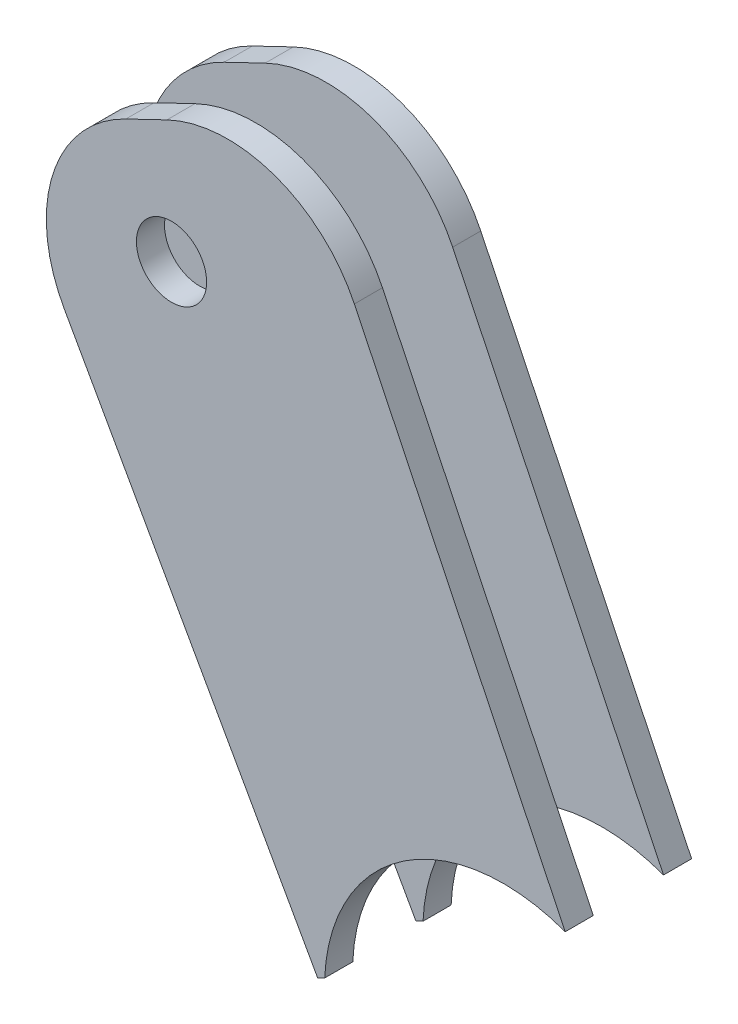
ISO-10303-21;
HEADER;
FILE_DESCRIPTION(('STEP AP214'),'2;1');
FILE_NAME('part.step','',(''),(''),'','','');
FILE_SCHEMA(('AUTOMOTIVE_DESIGN { 1 0 10303 214 1 1 1 1 }'));
ENDSEC;
DATA;
#1=APPLICATION_CONTEXT('core data for automotive mechanical design processes');
#2=APPLICATION_PROTOCOL_DEFINITION('international standard','automotive_design',2000,#1);
#3=PRODUCT_CONTEXT('',#1,'mechanical');
#4=PRODUCT('Part','Part','',(#3));
#5=PRODUCT_RELATED_PRODUCT_CATEGORY('part','',(#4));
#6=PRODUCT_DEFINITION_FORMATION('','',#4);
#7=PRODUCT_DEFINITION_CONTEXT('part definition',#1,'design');
#8=PRODUCT_DEFINITION('design','',#6,#7);
#9=PRODUCT_DEFINITION_SHAPE('','',#8);
#10=(LENGTH_UNIT() NAMED_UNIT(*) SI_UNIT(.MILLI.,.METRE.));
#11=(NAMED_UNIT(*) PLANE_ANGLE_UNIT() SI_UNIT($,.RADIAN.));
#12=(NAMED_UNIT(*) SI_UNIT($,.STERADIAN.) SOLID_ANGLE_UNIT());
#13=UNCERTAINTY_MEASURE_WITH_UNIT(LENGTH_MEASURE(1.E-05),#10,'distance_accuracy_value','');
#14=(GEOMETRIC_REPRESENTATION_CONTEXT(3) GLOBAL_UNCERTAINTY_ASSIGNED_CONTEXT((#13)) GLOBAL_UNIT_ASSIGNED_CONTEXT((#10,
#11,#12)) REPRESENTATION_CONTEXT('',''));
#15=CARTESIAN_POINT('',(0.,0.,0.));
#16=DIRECTION('',(0.,0.,1.));
#17=DIRECTION('',(1.,0.,0.));
#18=AXIS2_PLACEMENT_3D('',#15,#16,#17);
#19=CARTESIAN_POINT('',(211.866954819544,210.226139875916,7.));
#20=DIRECTION('',(0.,0.,1.));
#21=DIRECTION('',(-1.,0.,0.));
#22=AXIS2_PLACEMENT_3D('',#19,#20,#21);
#23=PLANE('',#22);
#24=CARTESIAN_POINT('',(234.421204701867,172.795325306794,7.));
#25=DIRECTION('',(0.,0.,-1.));
#26=DIRECTION('',(-1.,0.,0.));
#27=AXIS2_PLACEMENT_3D('',#24,#25,#26);
#28=CIRCLE('',#27,12.7458474253196);
#29=CARTESIAN_POINT('',(221.68738383472,173.348888955287,7.));
#30=VERTEX_POINT('',#29);
#31=CARTESIAN_POINT('',(238.810781533645,184.761454247577,7.));
#32=VERTEX_POINT('',#31);
#33=EDGE_CURVE('E130',#30,#32,#28,.T.);
#34=ORIENTED_EDGE('',*,*,#33,.T.);
#35=DIRECTION('',(0.433531044791866,-0.901138631511086,0.));
#36=VECTOR('',#35,1.);
#37=CARTESIAN_POINT('',(223.798382976734,215.966260578734,7.));
#38=LINE('',#37,#36);
#39=CARTESIAN_POINT('',(223.798382976734,215.966260578734,7.));
#40=VERTEX_POINT('',#39);
#41=EDGE_CURVE('E111',#40,#32,#38,.T.);
#42=ORIENTED_EDGE('',*,*,#41,.F.);
#43=CARTESIAN_POINT('',(214.786996661623,211.630950130815,7.));
#44=DIRECTION('',(0.,0.,-1.));
#45=DIRECTION('',(-1.,0.,0.));
#46=AXIS2_PLACEMENT_3D('',#43,#44,#45);
#47=CIRCLE('',#46,10.);
#48=CARTESIAN_POINT('',(210.451686213704,220.642336445926,7.));
#49=VERTEX_POINT('',#48);
#50=EDGE_CURVE('E122',#49,#40,#47,.T.);
#51=ORIENTED_EDGE('',*,*,#50,.F.);
#52=DIRECTION('',(0.901138631511083,0.433531044791873,0.));
#53=VECTOR('',#52,1.);
#54=CARTESIAN_POINT('',(207.531644371625,219.237526191027,7.));
#55=LINE('',#54,#53);
#56=CARTESIAN_POINT('',(207.531644371625,219.237526191027,7.));
#57=VERTEX_POINT('',#56);
#58=EDGE_CURVE('E126',#57,#49,#55,.T.);
#59=ORIENTED_EDGE('',*,*,#58,.F.);
#60=CARTESIAN_POINT('',(211.866954819544,210.226139875916,7.));
#61=DIRECTION('',(0.,0.,-1.));
#62=DIRECTION('',(-1.,0.,0.));
#63=AXIS2_PLACEMENT_3D('',#60,#61,#62);
#64=CIRCLE('',#63,9.99999999999998);
#65=CARTESIAN_POINT('',(203.140807268659,205.342048463975,7.));
#66=VERTEX_POINT('',#65);
#67=EDGE_CURVE('E155',#66,#57,#64,.T.);
#68=ORIENTED_EDGE('',*,*,#67,.F.);
#69=DIRECTION('',(-0.488409141194116,0.872614755088422,0.));
#70=VECTOR('',#69,1.);
#71=CARTESIAN_POINT('',(221.183345822055,173.106400043366,7.));
#72=LINE('',#71,#70);
#73=CARTESIAN_POINT('',(221.183345822055,173.106400043366,7.));
#74=VERTEX_POINT('',#73);
#75=EDGE_CURVE('E134',#74,#66,#72,.T.);
#76=ORIENTED_EDGE('',*,*,#75,.F.);
#77=DIRECTION('',(-0.901138631511086,-0.433531044791867,0.));
#78=VECTOR('',#77,1.);
#79=CARTESIAN_POINT('',(240.051018031475,182.183495797239,7.));
#80=LINE('',#79,#78);
#81=EDGE_CURVE('E131',#30,#74,#80,.T.);
#82=ORIENTED_EDGE('',*,*,#81,.F.);
#83=EDGE_LOOP('',(#34,#42,#51,#59,#68,#76,#82));
#84=FACE_BOUND('',#83,.T.);
#85=CARTESIAN_POINT('',(210.781303050667,212.057553234732,7.));
#86=DIRECTION('',(0.,0.,-1.));
#87=DIRECTION('',(-1.,0.,0.));
#88=AXIS2_PLACEMENT_3D('',#85,#86,#87);
#89=CIRCLE('',#88,2.5);
#90=CARTESIAN_POINT('',(208.281303050667,212.057553234732,7.));
#91=VERTEX_POINT('',#90);
#92=EDGE_CURVE('E143',#91,#91,#89,.T.);
#93=ORIENTED_EDGE('',*,*,#92,.T.);
#94=EDGE_LOOP('',(#93));
#95=FACE_BOUND('',#94,.T.);
#96=ADVANCED_FACE('F47',(#84,#95),#23,.T.);
#97=CARTESIAN_POINT('',(211.866954819544,210.226139875916,5.));
#98=DIRECTION('',(0.,0.,1.));
#99=DIRECTION('',(-1.,0.,0.));
#100=AXIS2_PLACEMENT_3D('',#97,#98,#99);
#101=PLANE('',#100);
#102=DIRECTION('',(-0.901138631511086,-0.433531044791867,0.));
#103=VECTOR('',#102,1.);
#104=CARTESIAN_POINT('',(240.051018031475,182.183495797239,5.));
#105=LINE('',#104,#103);
#106=CARTESIAN_POINT('',(221.68738383472,173.348888955287,5.));
#107=VERTEX_POINT('',#106);
#108=CARTESIAN_POINT('',(221.183345822055,173.106400043366,5.));
#109=VERTEX_POINT('',#108);
#110=EDGE_CURVE('E149',#107,#109,#105,.T.);
#111=ORIENTED_EDGE('',*,*,#110,.T.);
#112=DIRECTION('',(-0.488409141194116,0.872614755088422,0.));
#113=VECTOR('',#112,1.);
#114=CARTESIAN_POINT('',(221.183345822055,173.106400043366,5.));
#115=LINE('',#114,#113);
#116=CARTESIAN_POINT('',(203.140807268659,205.342048463975,5.));
#117=VERTEX_POINT('',#116);
#118=EDGE_CURVE('E152',#109,#117,#115,.T.);
#119=ORIENTED_EDGE('',*,*,#118,.T.);
#120=CARTESIAN_POINT('',(211.866954819544,210.226139875916,5.));
#121=DIRECTION('',(0.,0.,-1.));
#122=DIRECTION('',(-1.,0.,0.));
#123=AXIS2_PLACEMENT_3D('',#120,#121,#122);
#124=CIRCLE('',#123,9.99999999999998);
#125=CARTESIAN_POINT('',(207.531644371625,219.237526191027,5.));
#126=VERTEX_POINT('',#125);
#127=EDGE_CURVE('E139',#117,#126,#124,.T.);
#128=ORIENTED_EDGE('',*,*,#127,.T.);
#129=DIRECTION('',(0.901138631511083,0.433531044791873,0.));
#130=VECTOR('',#129,1.);
#131=CARTESIAN_POINT('',(207.531644371625,219.237526191027,5.));
#132=LINE('',#131,#130);
#133=CARTESIAN_POINT('',(210.451686213704,220.642336445926,5.));
#134=VERTEX_POINT('',#133);
#135=EDGE_CURVE('E142',#126,#134,#132,.T.);
#136=ORIENTED_EDGE('',*,*,#135,.T.);
#137=CARTESIAN_POINT('',(214.786996661623,211.630950130815,5.));
#138=DIRECTION('',(0.,0.,-1.));
#139=DIRECTION('',(-1.,0.,0.));
#140=AXIS2_PLACEMENT_3D('',#137,#138,#139);
#141=CIRCLE('',#140,10.);
#142=CARTESIAN_POINT('',(223.798382976734,215.966260578734,5.));
#143=VERTEX_POINT('',#142);
#144=EDGE_CURVE('E146',#134,#143,#141,.T.);
#145=ORIENTED_EDGE('',*,*,#144,.T.);
#146=DIRECTION('',(0.433531044791866,-0.901138631511086,0.));
#147=VECTOR('',#146,1.);
#148=CARTESIAN_POINT('',(223.798382976734,215.966260578734,5.));
#149=LINE('',#148,#147);
#150=CARTESIAN_POINT('',(238.810781533645,184.761454247577,5.));
#151=VERTEX_POINT('',#150);
#152=EDGE_CURVE('E114',#143,#151,#149,.T.);
#153=ORIENTED_EDGE('',*,*,#152,.T.);
#154=CARTESIAN_POINT('',(234.421204701867,172.795325306794,5.));
#155=DIRECTION('',(0.,0.,-1.));
#156=DIRECTION('',(-1.,0.,0.));
#157=AXIS2_PLACEMENT_3D('',#154,#155,#156);
#158=CIRCLE('',#157,12.7458474253196);
#159=EDGE_CURVE('E180',#107,#151,#158,.T.);
#160=ORIENTED_EDGE('',*,*,#159,.F.);
#161=EDGE_LOOP('',(#111,#119,#128,#136,#145,#153,#160));
#162=FACE_BOUND('',#161,.T.);
#163=CARTESIAN_POINT('',(210.781303050667,212.057553234732,5.));
#164=DIRECTION('',(0.,0.,-1.));
#165=DIRECTION('',(-1.,0.,0.));
#166=AXIS2_PLACEMENT_3D('',#163,#164,#165);
#167=CIRCLE('',#166,2.5);
#168=CARTESIAN_POINT('',(208.281303050667,212.057553234732,5.));
#169=VERTEX_POINT('',#168);
#170=EDGE_CURVE('E171',#169,#169,#167,.T.);
#171=ORIENTED_EDGE('',*,*,#170,.F.);
#172=EDGE_LOOP('',(#171));
#173=FACE_BOUND('',#172,.T.);
#174=ADVANCED_FACE('F161',(#162,#173),#101,.F.);
#175=CARTESIAN_POINT('',(211.866954819544,210.226139875916,7.));
#176=DIRECTION('',(0.,0.,-1.));
#177=DIRECTION('',(1.,0.,0.));
#178=AXIS2_PLACEMENT_3D('',#175,#176,#177);
#179=CYLINDRICAL_SURFACE('',#178,9.99999999999998);
#180=ORIENTED_EDGE('',*,*,#127,.F.);
#181=DIRECTION('',(0.,0.,-1.));
#182=VECTOR('',#181,1.);
#183=CARTESIAN_POINT('',(203.140807268659,205.342048463975,7.));
#184=LINE('',#183,#182);
#185=EDGE_CURVE('E69',#66,#117,#184,.T.);
#186=ORIENTED_EDGE('',*,*,#185,.F.);
#187=ORIENTED_EDGE('',*,*,#67,.T.);
#188=DIRECTION('',(0.,0.,-1.));
#189=VECTOR('',#188,1.);
#190=CARTESIAN_POINT('',(207.531644371625,219.237526191027,7.));
#191=LINE('',#190,#189);
#192=EDGE_CURVE('E55',#57,#126,#191,.T.);
#193=ORIENTED_EDGE('',*,*,#192,.T.);
#194=EDGE_LOOP('',(#180,#186,#187,#193));
#195=FACE_BOUND('',#194,.T.);
#196=ADVANCED_FACE('F49',(#195),#179,.T.);
#197=CARTESIAN_POINT('',(207.531644371625,219.237526191027,7.));
#198=DIRECTION('',(0.433531044791873,-0.901138631511083,0.));
#199=DIRECTION('',(0.901138631511083,0.433531044791873,0.));
#200=AXIS2_PLACEMENT_3D('',#197,#198,#199);
#201=PLANE('',#200);
#202=ORIENTED_EDGE('',*,*,#135,.F.);
#203=ORIENTED_EDGE('',*,*,#192,.F.);
#204=ORIENTED_EDGE('',*,*,#58,.T.);
#205=DIRECTION('',(0.,0.,-1.));
#206=VECTOR('',#205,1.);
#207=CARTESIAN_POINT('',(210.451686213704,220.642336445926,7.));
#208=LINE('',#207,#206);
#209=EDGE_CURVE('E118',#49,#134,#208,.T.);
#210=ORIENTED_EDGE('',*,*,#209,.T.);
#211=EDGE_LOOP('',(#202,#203,#204,#210));
#212=FACE_BOUND('',#211,.T.);
#213=ADVANCED_FACE('F159',(#212),#201,.F.);
#214=CARTESIAN_POINT('',(214.786996661623,211.630950130815,7.));
#215=DIRECTION('',(0.,0.,-1.));
#216=DIRECTION('',(1.,0.,0.));
#217=AXIS2_PLACEMENT_3D('',#214,#215,#216);
#218=CYLINDRICAL_SURFACE('',#217,10.);
#219=ORIENTED_EDGE('',*,*,#144,.F.);
#220=ORIENTED_EDGE('',*,*,#209,.F.);
#221=ORIENTED_EDGE('',*,*,#50,.T.);
#222=DIRECTION('',(0.,0.,-1.));
#223=VECTOR('',#222,1.);
#224=CARTESIAN_POINT('',(223.798382976734,215.966260578734,7.));
#225=LINE('',#224,#223);
#226=EDGE_CURVE('E106',#40,#143,#225,.T.);
#227=ORIENTED_EDGE('',*,*,#226,.T.);
#228=EDGE_LOOP('',(#219,#220,#221,#227));
#229=FACE_BOUND('',#228,.T.);
#230=ADVANCED_FACE('F123',(#229),#218,.T.);
#231=CARTESIAN_POINT('',(223.798382976734,215.966260578734,7.));
#232=DIRECTION('',(-0.901138631511086,-0.433531044791866,0.));
#233=DIRECTION('',(0.433531044791866,-0.901138631511086,0.));
#234=AXIS2_PLACEMENT_3D('',#231,#232,#233);
#235=PLANE('',#234);
#236=ORIENTED_EDGE('',*,*,#152,.F.);
#237=ORIENTED_EDGE('',*,*,#226,.F.);
#238=ORIENTED_EDGE('',*,*,#41,.T.);
#239=DIRECTION('',(0.,0.,-1.));
#240=VECTOR('',#239,1.);
#241=CARTESIAN_POINT('',(238.810781533645,184.761454247577,10.));
#242=LINE('',#241,#240);
#243=EDGE_CURVE('E174',#151,#32,#242,.F.);
#244=ORIENTED_EDGE('',*,*,#243,.F.);
#245=EDGE_LOOP('',(#236,#237,#238,#244));
#246=FACE_BOUND('',#245,.T.);
#247=ADVANCED_FACE('F108',(#246),#235,.F.);
#248=CARTESIAN_POINT('',(240.051018031475,182.183495797239,7.));
#249=DIRECTION('',(-0.433531044791867,0.901138631511086,0.));
#250=DIRECTION('',(-0.901138631511086,-0.433531044791867,0.));
#251=AXIS2_PLACEMENT_3D('',#248,#249,#250);
#252=PLANE('',#251);
#253=ORIENTED_EDGE('',*,*,#81,.T.);
#254=DIRECTION('',(0.,0.,-1.));
#255=VECTOR('',#254,1.);
#256=CARTESIAN_POINT('',(221.183345822055,173.106400043366,7.));
#257=LINE('',#256,#255);
#258=EDGE_CURVE('E119',#74,#109,#257,.T.);
#259=ORIENTED_EDGE('',*,*,#258,.T.);
#260=ORIENTED_EDGE('',*,*,#110,.F.);
#261=DIRECTION('',(0.,0.,-1.));
#262=VECTOR('',#261,1.);
#263=CARTESIAN_POINT('',(221.68738383472,173.348888955287,10.));
#264=LINE('',#263,#262);
#265=EDGE_CURVE('E12',#30,#107,#264,.T.);
#266=ORIENTED_EDGE('',*,*,#265,.F.);
#267=EDGE_LOOP('',(#253,#259,#260,#266));
#268=FACE_BOUND('',#267,.T.);
#269=ADVANCED_FACE('F167',(#268),#252,.F.);
#270=CARTESIAN_POINT('',(221.183345822055,173.106400043366,7.));
#271=DIRECTION('',(0.872614755088422,0.488409141194116,0.));
#272=DIRECTION('',(-0.488409141194116,0.872614755088422,0.));
#273=AXIS2_PLACEMENT_3D('',#270,#271,#272);
#274=PLANE('',#273);
#275=ORIENTED_EDGE('',*,*,#118,.F.);
#276=ORIENTED_EDGE('',*,*,#258,.F.);
#277=ORIENTED_EDGE('',*,*,#75,.T.);
#278=ORIENTED_EDGE('',*,*,#185,.T.);
#279=EDGE_LOOP('',(#275,#276,#277,#278));
#280=FACE_BOUND('',#279,.T.);
#281=ADVANCED_FACE('F164',(#280),#274,.F.);
#282=CARTESIAN_POINT('',(210.781303050667,212.057553234732,7.));
#283=DIRECTION('',(0.,0.,-1.));
#284=DIRECTION('',(1.,0.,0.));
#285=AXIS2_PLACEMENT_3D('',#282,#283,#284);
#286=CYLINDRICAL_SURFACE('',#285,2.5);
#287=ORIENTED_EDGE('',*,*,#92,.F.);
#288=EDGE_LOOP('',(#287));
#289=FACE_BOUND('',#288,.T.);
#290=ORIENTED_EDGE('',*,*,#170,.T.);
#291=EDGE_LOOP('',(#290));
#292=FACE_BOUND('',#291,.T.);
#293=ADVANCED_FACE('F185',(#289,#292),#286,.F.);
#294=CARTESIAN_POINT('',(234.421204701867,172.795325306794,10.));
#295=DIRECTION('',(0.,0.,-1.));
#296=DIRECTION('',(1.,0.,0.));
#297=AXIS2_PLACEMENT_3D('',#294,#295,#296);
#298=CYLINDRICAL_SURFACE('',#297,12.7458474253196);
#299=ORIENTED_EDGE('',*,*,#159,.T.);
#300=ORIENTED_EDGE('',*,*,#243,.T.);
#301=ORIENTED_EDGE('',*,*,#33,.F.);
#302=ORIENTED_EDGE('',*,*,#265,.T.);
#303=EDGE_LOOP('',(#299,#300,#301,#302));
#304=FACE_BOUND('',#303,.T.);
#305=ADVANCED_FACE('F182',(#304),#298,.F.);
#306=CLOSED_SHELL('',(#96,#174,#196,#213,#230,#247,#269,#281,#293,#305));
#307=MANIFOLD_SOLID_BREP('B2',#306);
#308=CARTESIAN_POINT('',(211.866954819544,210.226139875916,-2.));
#309=DIRECTION('',(0.,0.,-1.));
#310=DIRECTION('',(1.,0.,0.));
#311=AXIS2_PLACEMENT_3D('',#308,#309,#310);
#312=PLANE('',#311);
#313=CARTESIAN_POINT('',(234.421204701867,172.795325306794,-2.));
#314=DIRECTION('',(0.,0.,1.));
#315=DIRECTION('',(1.,0.,0.));
#316=AXIS2_PLACEMENT_3D('',#313,#314,#315);
#317=CIRCLE('',#316,12.7458474253196);
#318=CARTESIAN_POINT('',(238.810781533645,184.761454247577,-2.));
#319=VERTEX_POINT('',#318);
#320=CARTESIAN_POINT('',(221.68738383472,173.348888955287,-2.));
#321=VERTEX_POINT('',#320);
#322=EDGE_CURVE('E390',#319,#321,#317,.T.);
#323=ORIENTED_EDGE('',*,*,#322,.T.);
#324=DIRECTION('',(0.901138631511086,0.433531044791867,0.));
#325=VECTOR('',#324,1.);
#326=CARTESIAN_POINT('',(240.051018031475,182.183495797239,-2.));
#327=LINE('',#326,#325);
#328=CARTESIAN_POINT('',(221.183345822055,173.106400043366,-2.));
#329=VERTEX_POINT('',#328);
#330=EDGE_CURVE('E375',#329,#321,#327,.T.);
#331=ORIENTED_EDGE('',*,*,#330,.F.);
#332=DIRECTION('',(0.488409141194116,-0.872614755088422,0.));
#333=VECTOR('',#332,1.);
#334=CARTESIAN_POINT('',(221.183345822055,173.106400043366,-2.));
#335=LINE('',#334,#333);
#336=CARTESIAN_POINT('',(203.140807268659,205.342048463975,-2.));
#337=VERTEX_POINT('',#336);
#338=EDGE_CURVE('E354',#337,#329,#335,.T.);
#339=ORIENTED_EDGE('',*,*,#338,.F.);
#340=CARTESIAN_POINT('',(211.866954819544,210.226139875916,-2.));
#341=DIRECTION('',(0.,0.,1.));
#342=DIRECTION('',(1.,0.,0.));
#343=AXIS2_PLACEMENT_3D('',#340,#341,#342);
#344=CIRCLE('',#343,9.99999999999998);
#345=CARTESIAN_POINT('',(207.531644371625,219.237526191027,-2.));
#346=VERTEX_POINT('',#345);
#347=EDGE_CURVE('E334',#346,#337,#344,.T.);
#348=ORIENTED_EDGE('',*,*,#347,.F.);
#349=DIRECTION('',(-0.901138631511086,-0.433531044791866,0.));
#350=VECTOR('',#349,1.);
#351=CARTESIAN_POINT('',(207.531644371625,219.237526191027,-2.));
#352=LINE('',#351,#350);
#353=CARTESIAN_POINT('',(210.451686213704,220.642336445926,-2.));
#354=VERTEX_POINT('',#353);
#355=EDGE_CURVE('E345',#354,#346,#352,.T.);
#356=ORIENTED_EDGE('',*,*,#355,.F.);
#357=CARTESIAN_POINT('',(214.786996661623,211.630950130815,-2.));
#358=DIRECTION('',(0.,0.,1.));
#359=DIRECTION('',(-1.,0.,0.));
#360=AXIS2_PLACEMENT_3D('',#357,#358,#359);
#361=CIRCLE('',#360,9.99999999999999);
#362=CARTESIAN_POINT('',(223.798382976734,215.966260578734,-2.));
#363=VERTEX_POINT('',#362);
#364=EDGE_CURVE('E349',#363,#354,#361,.T.);
#365=ORIENTED_EDGE('',*,*,#364,.F.);
#366=DIRECTION('',(-0.433531044791866,0.901138631511086,0.));
#367=VECTOR('',#366,1.);
#368=CARTESIAN_POINT('',(223.798382976734,215.966260578734,-2.));
#369=LINE('',#368,#367);
#370=EDGE_CURVE('E382',#319,#363,#369,.T.);
#371=ORIENTED_EDGE('',*,*,#370,.F.);
#372=EDGE_LOOP('',(#323,#331,#339,#348,#356,#365,#371));
#373=FACE_BOUND('',#372,.T.);
#374=CARTESIAN_POINT('',(210.781303050667,212.057553234732,-2.));
#375=DIRECTION('',(0.,0.,1.));
#376=DIRECTION('',(1.,0.,0.));
#377=AXIS2_PLACEMENT_3D('',#374,#375,#376);
#378=CIRCLE('',#377,2.5);
#379=CARTESIAN_POINT('',(213.281303050667,212.057553234732,-2.));
#380=VERTEX_POINT('',#379);
#381=EDGE_CURVE('E363',#380,#380,#378,.T.);
#382=ORIENTED_EDGE('',*,*,#381,.T.);
#383=EDGE_LOOP('',(#382));
#384=FACE_BOUND('',#383,.T.);
#385=ADVANCED_FACE('F270',(#373,#384),#312,.T.);
#386=CARTESIAN_POINT('',(211.866954819544,210.226139875916,0.));
#387=DIRECTION('',(0.,0.,-1.));
#388=DIRECTION('',(1.,0.,0.));
#389=AXIS2_PLACEMENT_3D('',#386,#387,#388);
#390=PLANE('',#389);
#391=DIRECTION('',(-0.433531044791866,0.901138631511086,0.));
#392=VECTOR('',#391,1.);
#393=CARTESIAN_POINT('',(223.798382976734,215.966260578734,0.));
#394=LINE('',#393,#392);
#395=CARTESIAN_POINT('',(238.810781533645,184.761454247577,0.));
#396=VERTEX_POINT('',#395);
#397=CARTESIAN_POINT('',(223.798382976734,215.966260578734,0.));
#398=VERTEX_POINT('',#397);
#399=EDGE_CURVE('E362',#396,#398,#394,.T.);
#400=ORIENTED_EDGE('',*,*,#399,.T.);
#401=CARTESIAN_POINT('',(214.786996661623,211.630950130815,0.));
#402=DIRECTION('',(0.,0.,1.));
#403=DIRECTION('',(-1.,0.,0.));
#404=AXIS2_PLACEMENT_3D('',#401,#402,#403);
#405=CIRCLE('',#404,9.99999999999999);
#406=CARTESIAN_POINT('',(210.451686213704,220.642336445926,0.));
#407=VERTEX_POINT('',#406);
#408=EDGE_CURVE('E366',#398,#407,#405,.T.);
#409=ORIENTED_EDGE('',*,*,#408,.T.);
#410=DIRECTION('',(-0.901138631511086,-0.433531044791866,0.));
#411=VECTOR('',#410,1.);
#412=CARTESIAN_POINT('',(207.531644371625,219.237526191027,0.));
#413=LINE('',#412,#411);
#414=CARTESIAN_POINT('',(207.531644371625,219.237526191027,0.));
#415=VERTEX_POINT('',#414);
#416=EDGE_CURVE('E369',#407,#415,#413,.T.);
#417=ORIENTED_EDGE('',*,*,#416,.T.);
#418=CARTESIAN_POINT('',(211.866954819544,210.226139875916,0.));
#419=DIRECTION('',(0.,0.,1.));
#420=DIRECTION('',(1.,0.,0.));
#421=AXIS2_PLACEMENT_3D('',#418,#419,#420);
#422=CIRCLE('',#421,9.99999999999998);
#423=CARTESIAN_POINT('',(203.140807268659,205.342048463975,0.));
#424=VERTEX_POINT('',#423);
#425=EDGE_CURVE('E337',#415,#424,#422,.T.);
#426=ORIENTED_EDGE('',*,*,#425,.T.);
#427=DIRECTION('',(0.488409141194116,-0.872614755088422,0.));
#428=VECTOR('',#427,1.);
#429=CARTESIAN_POINT('',(221.183345822055,173.106400043366,0.));
#430=LINE('',#429,#428);
#431=CARTESIAN_POINT('',(221.183345822055,173.106400043366,0.));
#432=VERTEX_POINT('',#431);
#433=EDGE_CURVE('E372',#424,#432,#430,.T.);
#434=ORIENTED_EDGE('',*,*,#433,.T.);
#435=DIRECTION('',(0.901138631511086,0.433531044791867,0.));
#436=VECTOR('',#435,1.);
#437=CARTESIAN_POINT('',(240.051018031475,182.183495797239,0.));
#438=LINE('',#437,#436);
#439=CARTESIAN_POINT('',(221.68738383472,173.348888955287,0.));
#440=VERTEX_POINT('',#439);
#441=EDGE_CURVE('E359',#432,#440,#438,.T.);
#442=ORIENTED_EDGE('',*,*,#441,.T.);
#443=CARTESIAN_POINT('',(234.421204701867,172.795325306794,0.));
#444=DIRECTION('',(0.,0.,1.));
#445=DIRECTION('',(1.,0.,0.));
#446=AXIS2_PLACEMENT_3D('',#443,#444,#445);
#447=CIRCLE('',#446,12.7458474253196);
#448=EDGE_CURVE('E387',#396,#440,#447,.T.);
#449=ORIENTED_EDGE('',*,*,#448,.F.);
#450=EDGE_LOOP('',(#400,#409,#417,#426,#434,#442,#449));
#451=FACE_BOUND('',#450,.T.);
#452=CARTESIAN_POINT('',(210.781303050667,212.057553234732,0.));
#453=DIRECTION('',(0.,0.,1.));
#454=DIRECTION('',(1.,0.,0.));
#455=AXIS2_PLACEMENT_3D('',#452,#453,#454);
#456=CIRCLE('',#455,2.5);
#457=CARTESIAN_POINT('',(213.281303050667,212.057553234732,0.));
#458=VERTEX_POINT('',#457);
#459=EDGE_CURVE('E392',#458,#458,#456,.T.);
#460=ORIENTED_EDGE('',*,*,#459,.F.);
#461=EDGE_LOOP('',(#460));
#462=FACE_BOUND('',#461,.T.);
#463=ADVANCED_FACE('F385',(#451,#462),#390,.F.);
#464=CARTESIAN_POINT('',(240.051018031475,182.183495797239,-2.));
#465=DIRECTION('',(-0.433531044791867,0.901138631511086,0.));
#466=DIRECTION('',(-0.901138631511086,-0.433531044791867,0.));
#467=AXIS2_PLACEMENT_3D('',#464,#465,#466);
#468=PLANE('',#467);
#469=ORIENTED_EDGE('',*,*,#441,.F.);
#470=DIRECTION('',(0.,0.,1.));
#471=VECTOR('',#470,1.);
#472=CARTESIAN_POINT('',(221.183345822055,173.106400043366,-2.));
#473=LINE('',#472,#471);
#474=EDGE_CURVE('E292',#329,#432,#473,.T.);
#475=ORIENTED_EDGE('',*,*,#474,.F.);
#476=ORIENTED_EDGE('',*,*,#330,.T.);
#477=DIRECTION('',(0.,0.,-1.));
#478=VECTOR('',#477,1.);
#479=CARTESIAN_POINT('',(221.68738383472,173.348888955287,10.));
#480=LINE('',#479,#478);
#481=EDGE_CURVE('E389',#440,#321,#480,.T.);
#482=ORIENTED_EDGE('',*,*,#481,.F.);
#483=EDGE_LOOP('',(#469,#475,#476,#482));
#484=FACE_BOUND('',#483,.T.);
#485=ADVANCED_FACE('F272',(#484),#468,.F.);
#486=CARTESIAN_POINT('',(223.798382976734,215.966260578734,-2.));
#487=DIRECTION('',(-0.901138631511086,-0.433531044791866,0.));
#488=DIRECTION('',(0.433531044791866,-0.901138631511086,0.));
#489=AXIS2_PLACEMENT_3D('',#486,#487,#488);
#490=PLANE('',#489);
#491=ORIENTED_EDGE('',*,*,#370,.T.);
#492=DIRECTION('',(0.,0.,1.));
#493=VECTOR('',#492,1.);
#494=CARTESIAN_POINT('',(223.798382976734,215.966260578734,-2.));
#495=LINE('',#494,#493);
#496=EDGE_CURVE('E278',#363,#398,#495,.T.);
#497=ORIENTED_EDGE('',*,*,#496,.T.);
#498=ORIENTED_EDGE('',*,*,#399,.F.);
#499=DIRECTION('',(0.,0.,-1.));
#500=VECTOR('',#499,1.);
#501=CARTESIAN_POINT('',(238.810781533645,184.761454247577,10.));
#502=LINE('',#501,#500);
#503=EDGE_CURVE('E45',#319,#396,#502,.F.);
#504=ORIENTED_EDGE('',*,*,#503,.F.);
#505=EDGE_LOOP('',(#491,#497,#498,#504));
#506=FACE_BOUND('',#505,.T.);
#507=ADVANCED_FACE('F380',(#506),#490,.F.);
#508=CARTESIAN_POINT('',(214.786996661623,211.630950130815,-2.));
#509=DIRECTION('',(0.,0.,1.));
#510=DIRECTION('',(-1.,0.,0.));
#511=AXIS2_PLACEMENT_3D('',#508,#509,#510);
#512=CYLINDRICAL_SURFACE('',#511,9.99999999999999);
#513=ORIENTED_EDGE('',*,*,#408,.F.);
#514=ORIENTED_EDGE('',*,*,#496,.F.);
#515=ORIENTED_EDGE('',*,*,#364,.T.);
#516=DIRECTION('',(0.,0.,1.));
#517=VECTOR('',#516,1.);
#518=CARTESIAN_POINT('',(210.451686213704,220.642336445926,-2.));
#519=LINE('',#518,#517);
#520=EDGE_CURVE('E341',#354,#407,#519,.T.);
#521=ORIENTED_EDGE('',*,*,#520,.T.);
#522=EDGE_LOOP('',(#513,#514,#515,#521));
#523=FACE_BOUND('',#522,.T.);
#524=ADVANCED_FACE('F383',(#523),#512,.T.);
#525=CARTESIAN_POINT('',(207.531644371625,219.237526191027,-2.));
#526=DIRECTION('',(0.433531044791866,-0.901138631511086,0.));
#527=DIRECTION('',(0.901138631511086,0.433531044791866,0.));
#528=AXIS2_PLACEMENT_3D('',#525,#526,#527);
#529=PLANE('',#528);
#530=ORIENTED_EDGE('',*,*,#416,.F.);
#531=ORIENTED_EDGE('',*,*,#520,.F.);
#532=ORIENTED_EDGE('',*,*,#355,.T.);
#533=DIRECTION('',(0.,0.,1.));
#534=VECTOR('',#533,1.);
#535=CARTESIAN_POINT('',(207.531644371625,219.237526191027,-2.));
#536=LINE('',#535,#534);
#537=EDGE_CURVE('E330',#346,#415,#536,.T.);
#538=ORIENTED_EDGE('',*,*,#537,.T.);
#539=EDGE_LOOP('',(#530,#531,#532,#538));
#540=FACE_BOUND('',#539,.T.);
#541=ADVANCED_FACE('F346',(#540),#529,.F.);
#542=CARTESIAN_POINT('',(211.866954819544,210.226139875916,-2.));
#543=DIRECTION('',(0.,0.,1.));
#544=DIRECTION('',(-1.,0.,0.));
#545=AXIS2_PLACEMENT_3D('',#542,#543,#544);
#546=CYLINDRICAL_SURFACE('',#545,9.99999999999998);
#547=ORIENTED_EDGE('',*,*,#425,.F.);
#548=ORIENTED_EDGE('',*,*,#537,.F.);
#549=ORIENTED_EDGE('',*,*,#347,.T.);
#550=DIRECTION('',(0.,0.,1.));
#551=VECTOR('',#550,1.);
#552=CARTESIAN_POINT('',(203.140807268659,205.342048463975,-2.));
#553=LINE('',#552,#551);
#554=EDGE_CURVE('E342',#337,#424,#553,.T.);
#555=ORIENTED_EDGE('',*,*,#554,.T.);
#556=EDGE_LOOP('',(#547,#548,#549,#555));
#557=FACE_BOUND('',#556,.T.);
#558=ADVANCED_FACE('F332',(#557),#546,.T.);
#559=CARTESIAN_POINT('',(221.183345822055,173.106400043366,-2.));
#560=DIRECTION('',(0.872614755088422,0.488409141194116,0.));
#561=DIRECTION('',(-0.488409141194116,0.872614755088422,0.));
#562=AXIS2_PLACEMENT_3D('',#559,#560,#561);
#563=PLANE('',#562);
#564=ORIENTED_EDGE('',*,*,#433,.F.);
#565=ORIENTED_EDGE('',*,*,#554,.F.);
#566=ORIENTED_EDGE('',*,*,#338,.T.);
#567=ORIENTED_EDGE('',*,*,#474,.T.);
#568=EDGE_LOOP('',(#564,#565,#566,#567));
#569=FACE_BOUND('',#568,.T.);
#570=ADVANCED_FACE('F420',(#569),#563,.F.);
#571=CARTESIAN_POINT('',(210.781303050667,212.057553234732,-2.));
#572=DIRECTION('',(0.,0.,1.));
#573=DIRECTION('',(-1.,0.,0.));
#574=AXIS2_PLACEMENT_3D('',#571,#572,#573);
#575=CYLINDRICAL_SURFACE('',#574,2.5);
#576=ORIENTED_EDGE('',*,*,#381,.F.);
#577=EDGE_LOOP('',(#576));
#578=FACE_BOUND('',#577,.T.);
#579=ORIENTED_EDGE('',*,*,#459,.T.);
#580=EDGE_LOOP('',(#579));
#581=FACE_BOUND('',#580,.T.);
#582=ADVANCED_FACE('F417',(#578,#581),#575,.F.);
#583=CARTESIAN_POINT('',(234.421204701867,172.795325306794,10.));
#584=DIRECTION('',(0.,0.,-1.));
#585=DIRECTION('',(1.,0.,0.));
#586=AXIS2_PLACEMENT_3D('',#583,#584,#585);
#587=CYLINDRICAL_SURFACE('',#586,12.7458474253196);
#588=ORIENTED_EDGE('',*,*,#448,.T.);
#589=ORIENTED_EDGE('',*,*,#481,.T.);
#590=ORIENTED_EDGE('',*,*,#322,.F.);
#591=ORIENTED_EDGE('',*,*,#503,.T.);
#592=EDGE_LOOP('',(#588,#589,#590,#591));
#593=FACE_BOUND('',#592,.T.);
#594=ADVANCED_FACE('F404',(#593),#587,.F.);
#595=CLOSED_SHELL('',(#385,#463,#485,#507,#524,#541,#558,#570,#582,#594));
#596=MANIFOLD_SOLID_BREP('B6',#595);
#597=ADVANCED_BREP_SHAPE_REPRESENTATION('',(#18,#307,#596),#14);
#598=SHAPE_DEFINITION_REPRESENTATION(#9,#597);
ENDSEC;
END-ISO-10303-21;
